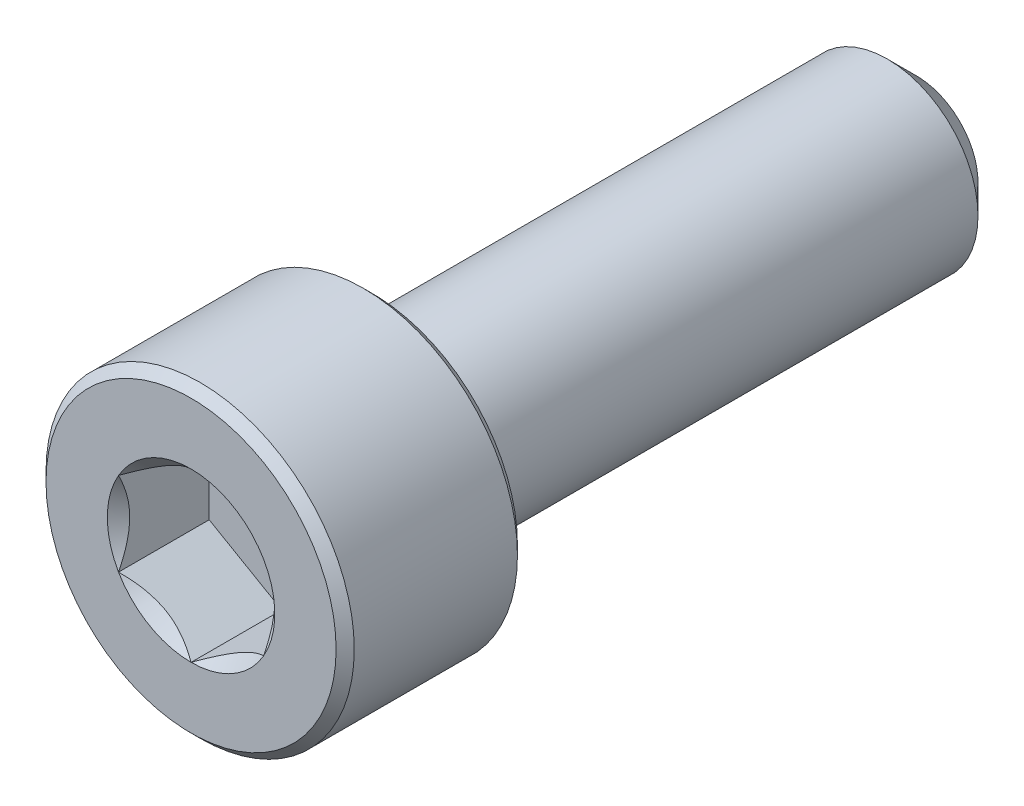
ISO-10303-21;
HEADER;
FILE_DESCRIPTION(('STEP AP214'),'2;1');
FILE_NAME('part.step','',(''),(''),'','','');
FILE_SCHEMA(('AUTOMOTIVE_DESIGN { 1 0 10303 214 1 1 1 1 }'));
ENDSEC;
DATA;
#1=APPLICATION_CONTEXT('core data for automotive mechanical design processes');
#2=APPLICATION_PROTOCOL_DEFINITION('international standard','automotive_design',2000,#1);
#3=PRODUCT_CONTEXT('',#1,'mechanical');
#4=PRODUCT('Part','Part','',(#3));
#5=PRODUCT_RELATED_PRODUCT_CATEGORY('part','',(#4));
#6=PRODUCT_DEFINITION_FORMATION('','',#4);
#7=PRODUCT_DEFINITION_CONTEXT('part definition',#1,'design');
#8=PRODUCT_DEFINITION('design','',#6,#7);
#9=PRODUCT_DEFINITION_SHAPE('','',#8);
#10=(LENGTH_UNIT() NAMED_UNIT(*) SI_UNIT(.MILLI.,.METRE.));
#11=(NAMED_UNIT(*) PLANE_ANGLE_UNIT() SI_UNIT($,.RADIAN.));
#12=(NAMED_UNIT(*) SI_UNIT($,.STERADIAN.) SOLID_ANGLE_UNIT());
#13=UNCERTAINTY_MEASURE_WITH_UNIT(LENGTH_MEASURE(1.E-05),#10,'distance_accuracy_value','');
#14=(GEOMETRIC_REPRESENTATION_CONTEXT(3) GLOBAL_UNCERTAINTY_ASSIGNED_CONTEXT((#13)) GLOBAL_UNIT_ASSIGNED_CONTEXT((#10,
#11,#12)) REPRESENTATION_CONTEXT('',''));
#15=CARTESIAN_POINT('',(0.,0.,0.));
#16=DIRECTION('',(0.,0.,1.));
#17=DIRECTION('',(1.,0.,0.));
#18=AXIS2_PLACEMENT_3D('',#15,#16,#17);
#19=CARTESIAN_POINT('',(0.,4.,10.));
#20=DIRECTION('',(0.,0.,1.));
#21=DIRECTION('',(1.,0.,0.));
#22=AXIS2_PLACEMENT_3D('',#19,#20,#21);
#23=PLANE('',#22);
#24=CARTESIAN_POINT('',(0.,0.,10.));
#25=DIRECTION('',(0.,0.,1.));
#26=DIRECTION('',(1.,0.,0.));
#27=AXIS2_PLACEMENT_3D('',#24,#25,#26);
#28=CIRCLE('',#27,2.3094010767585);
#29=CARTESIAN_POINT('',(2.,1.15470053837925,10.));
#30=VERTEX_POINT('',#29);
#31=CARTESIAN_POINT('',(0.,2.3094010767585,10.));
#32=VERTEX_POINT('',#31);
#33=EDGE_CURVE('E92',#30,#32,#28,.T.);
#34=ORIENTED_EDGE('',*,*,#33,.F.);
#35=CARTESIAN_POINT('',(2.,-1.15470053837925,10.));
#36=VERTEX_POINT('',#35);
#37=EDGE_CURVE('E52',#36,#30,#28,.T.);
#38=ORIENTED_EDGE('',*,*,#37,.F.);
#39=CARTESIAN_POINT('',(0.,-2.3094010767585,10.));
#40=VERTEX_POINT('',#39);
#41=EDGE_CURVE('E278',#40,#36,#28,.T.);
#42=ORIENTED_EDGE('',*,*,#41,.F.);
#43=CARTESIAN_POINT('',(-2.,-1.15470053837925,10.));
#44=VERTEX_POINT('',#43);
#45=EDGE_CURVE('E59',#44,#40,#28,.T.);
#46=ORIENTED_EDGE('',*,*,#45,.F.);
#47=CARTESIAN_POINT('',(-2.,1.15470053837925,10.));
#48=VERTEX_POINT('',#47);
#49=EDGE_CURVE('E128',#48,#44,#28,.T.);
#50=ORIENTED_EDGE('',*,*,#49,.F.);
#51=EDGE_CURVE('E101',#32,#48,#28,.T.);
#52=ORIENTED_EDGE('',*,*,#51,.F.);
#53=EDGE_LOOP('',(#34,#38,#42,#46,#50,#52));
#54=FACE_BOUND('',#53,.T.);
#55=CARTESIAN_POINT('',(0.,0.,10.));
#56=DIRECTION('',(0.,0.,-1.));
#57=DIRECTION('',(-1.,0.,0.));
#58=AXIS2_PLACEMENT_3D('',#55,#56,#57);
#59=CIRCLE('',#58,4.);
#60=CARTESIAN_POINT('',(-4.,0.,10.));
#61=VERTEX_POINT('',#60);
#62=EDGE_CURVE('E46',#61,#61,#59,.T.);
#63=ORIENTED_EDGE('',*,*,#62,.F.);
#64=EDGE_LOOP('',(#63));
#65=FACE_BOUND('',#64,.T.);
#66=ADVANCED_FACE('F33',(#54,#65),#23,.T.);
#67=CARTESIAN_POINT('',(0.,0.,9.75));
#68=DIRECTION('',(0.,0.,-1.));
#69=DIRECTION('',(-1.,0.,0.));
#70=AXIS2_PLACEMENT_3D('',#67,#68,#69);
#71=CONICAL_SURFACE('',#70,4.25,0.78539816339745);
#72=ORIENTED_EDGE('',*,*,#62,.T.);
#73=EDGE_LOOP('',(#72));
#74=FACE_BOUND('',#73,.T.);
#75=CARTESIAN_POINT('',(0.,0.,9.75));
#76=DIRECTION('',(0.,0.,-1.));
#77=DIRECTION('',(-1.,0.,0.));
#78=AXIS2_PLACEMENT_3D('',#75,#76,#77);
#79=CIRCLE('',#78,4.25);
#80=CARTESIAN_POINT('',(-4.25,0.,9.75));
#81=VERTEX_POINT('',#80);
#82=EDGE_CURVE('E212',#81,#81,#79,.T.);
#83=ORIENTED_EDGE('',*,*,#82,.F.);
#84=EDGE_LOOP('',(#83));
#85=FACE_BOUND('',#84,.T.);
#86=ADVANCED_FACE('F217',(#74,#85),#71,.T.);
#87=CARTESIAN_POINT('',(0.,0.,-10.));
#88=DIRECTION('',(0.,0.,-1.));
#89=DIRECTION('',(-1.,0.,0.));
#90=AXIS2_PLACEMENT_3D('',#87,#88,#89);
#91=CYLINDRICAL_SURFACE('',#90,4.25);
#92=ORIENTED_EDGE('',*,*,#82,.T.);
#93=EDGE_LOOP('',(#92));
#94=FACE_BOUND('',#93,.T.);
#95=CARTESIAN_POINT('',(0.,0.,5.25));
#96=DIRECTION('',(0.,0.,-1.));
#97=DIRECTION('',(-1.,0.,0.));
#98=AXIS2_PLACEMENT_3D('',#95,#96,#97);
#99=CIRCLE('',#98,4.25);
#100=CARTESIAN_POINT('',(-4.25,0.,5.25));
#101=VERTEX_POINT('',#100);
#102=EDGE_CURVE('E209',#101,#101,#99,.T.);
#103=ORIENTED_EDGE('',*,*,#102,.F.);
#104=EDGE_LOOP('',(#103));
#105=FACE_BOUND('',#104,.T.);
#106=ADVANCED_FACE('F223',(#94,#105),#91,.T.);
#107=CARTESIAN_POINT('',(0.,0.,5.));
#108=DIRECTION('',(0.,0.,1.));
#109=DIRECTION('',(1.,0.,0.));
#110=AXIS2_PLACEMENT_3D('',#107,#108,#109);
#111=CONICAL_SURFACE('',#110,4.,0.785398163397452);
#112=ORIENTED_EDGE('',*,*,#102,.T.);
#113=EDGE_LOOP('',(#112));
#114=FACE_BOUND('',#113,.T.);
#115=CARTESIAN_POINT('',(0.,0.,5.));
#116=DIRECTION('',(0.,0.,-1.));
#117=DIRECTION('',(-1.,0.,0.));
#118=AXIS2_PLACEMENT_3D('',#115,#116,#117);
#119=CIRCLE('',#118,4.);
#120=CARTESIAN_POINT('',(-4.,0.,5.));
#121=VERTEX_POINT('',#120);
#122=EDGE_CURVE('E206',#121,#121,#119,.T.);
#123=ORIENTED_EDGE('',*,*,#122,.F.);
#124=EDGE_LOOP('',(#123));
#125=FACE_BOUND('',#124,.T.);
#126=ADVANCED_FACE('F227',(#114,#125),#111,.T.);
#127=CARTESIAN_POINT('',(0.,4.,5.));
#128=DIRECTION('',(0.,0.,-1.));
#129=DIRECTION('',(-1.,0.,0.));
#130=AXIS2_PLACEMENT_3D('',#127,#128,#129);
#131=PLANE('',#130);
#132=ORIENTED_EDGE('',*,*,#122,.T.);
#133=EDGE_LOOP('',(#132));
#134=FACE_BOUND('',#133,.T.);
#135=CARTESIAN_POINT('',(0.,0.,5.));
#136=DIRECTION('',(0.,0.,-1.));
#137=DIRECTION('',(-1.,0.,0.));
#138=AXIS2_PLACEMENT_3D('',#135,#136,#137);
#139=CIRCLE('',#138,2.5);
#140=CARTESIAN_POINT('',(-2.5,0.,5.));
#141=VERTEX_POINT('',#140);
#142=EDGE_CURVE('E203',#141,#141,#139,.T.);
#143=ORIENTED_EDGE('',*,*,#142,.F.);
#144=EDGE_LOOP('',(#143));
#145=FACE_BOUND('',#144,.T.);
#146=ADVANCED_FACE('F233',(#134,#145),#131,.T.);
#147=CARTESIAN_POINT('',(0.,0.,-10.));
#148=DIRECTION('',(0.,0.,-1.));
#149=DIRECTION('',(-1.,0.,0.));
#150=AXIS2_PLACEMENT_3D('',#147,#148,#149);
#151=CYLINDRICAL_SURFACE('',#150,2.5);
#152=ORIENTED_EDGE('',*,*,#142,.T.);
#153=EDGE_LOOP('',(#152));
#154=FACE_BOUND('',#153,.T.);
#155=CARTESIAN_POINT('',(0.,0.,-9.19999999999999));
#156=DIRECTION('',(0.,0.,-1.));
#157=DIRECTION('',(-1.,0.,0.));
#158=AXIS2_PLACEMENT_3D('',#155,#156,#157);
#159=CIRCLE('',#158,2.5);
#160=CARTESIAN_POINT('',(-2.5,0.,-9.19999999999999));
#161=VERTEX_POINT('',#160);
#162=EDGE_CURVE('E200',#161,#161,#159,.T.);
#163=ORIENTED_EDGE('',*,*,#162,.F.);
#164=EDGE_LOOP('',(#163));
#165=FACE_BOUND('',#164,.T.);
#166=ADVANCED_FACE('F237',(#154,#165),#151,.T.);
#167=CARTESIAN_POINT('',(0.,0.,-10.));
#168=DIRECTION('',(0.,0.,1.));
#169=DIRECTION('',(1.,0.,0.));
#170=AXIS2_PLACEMENT_3D('',#167,#168,#169);
#171=CONICAL_SURFACE('',#170,1.7,0.785398163397443);
#172=ORIENTED_EDGE('',*,*,#162,.T.);
#173=EDGE_LOOP('',(#172));
#174=FACE_BOUND('',#173,.T.);
#175=CARTESIAN_POINT('',(0.,0.,-10.));
#176=DIRECTION('',(0.,0.,-1.));
#177=DIRECTION('',(-1.,0.,0.));
#178=AXIS2_PLACEMENT_3D('',#175,#176,#177);
#179=CIRCLE('',#178,1.7);
#180=CARTESIAN_POINT('',(-1.7,0.,-10.));
#181=VERTEX_POINT('',#180);
#182=EDGE_CURVE('E188',#181,#181,#179,.T.);
#183=ORIENTED_EDGE('',*,*,#182,.F.);
#184=EDGE_LOOP('',(#183));
#185=FACE_BOUND('',#184,.T.);
#186=ADVANCED_FACE('F240',(#174,#185),#171,.T.);
#187=CARTESIAN_POINT('',(0.,1.7,-10.));
#188=DIRECTION('',(0.,0.,-1.));
#189=DIRECTION('',(-1.,0.,0.));
#190=AXIS2_PLACEMENT_3D('',#187,#188,#189);
#191=PLANE('',#190);
#192=ORIENTED_EDGE('',*,*,#182,.T.);
#193=EDGE_LOOP('',(#192));
#194=FACE_BOUND('',#193,.T.);
#195=ADVANCED_FACE('F161',(#194),#191,.T.);
#196=CARTESIAN_POINT('',(0.,0.,10.));
#197=DIRECTION('',(0.,0.,1.));
#198=DIRECTION('',(1.,0.,0.));
#199=AXIS2_PLACEMENT_3D('',#196,#197,#198);
#200=CONICAL_SURFACE('',#199,2.3094010767585,0.78539816339745);
#201=ORIENTED_EDGE('',*,*,#51,.T.);
#202=CARTESIAN_POINT('',(0.000200000000000219,2.30951654681234,10.0001154787137));
#203=CARTESIAN_POINT('',(-0.068553034030705,2.26982196410711,9.96045309022559));
#204=CARTESIAN_POINT('',(-0.138455742135511,2.22946361676572,9.92311998228416));
#205=CARTESIAN_POINT('',(-0.280995244550436,2.14716839667631,9.85476368513615));
#206=CARTESIAN_POINT('',(-0.353645597565358,2.10522369580642,9.82377853373722));
#207=CARTESIAN_POINT('',(-0.500141601053971,2.02064418875706,9.77070021654414));
#208=CARTESIAN_POINT('',(-0.573949935246294,1.97803092714269,9.74847362717661));
#209=CARTESIAN_POINT('',(-0.723191631835264,1.89186619344273,9.71422881667508));
#210=CARTESIAN_POINT('',(-0.798620433918152,1.84831735425552,9.70218502914414));
#211=CARTESIAN_POINT('',(-0.928615500671079,1.7732646674724,9.69131851190557));
#212=CARTESIAN_POINT('',(-0.983013783970109,1.74185780396625,9.68970975360997));
#213=CARTESIAN_POINT('',(-1.09172145551969,1.67909540053412,9.69241887759871));
#214=CARTESIAN_POINT('',(-1.14603080592134,1.64773988246022,9.69673883775797));
#215=CARTESIAN_POINT('',(-1.25413672758934,1.5853248994842,9.71105956740991));
#216=CARTESIAN_POINT('',(-1.30793265655479,1.55426580541469,9.72106669276201));
#217=CARTESIAN_POINT('',(-1.41459426230557,1.49268469862228,9.74621243024966));
#218=CARTESIAN_POINT('',(-1.46746001007071,1.46216264491917,9.76135064904224));
#219=CARTESIAN_POINT('',(-1.60287973308984,1.38397803138049,9.80629450342919));
#220=CARTESIAN_POINT('',(-1.68459383484948,1.33680037273297,9.83948883942582));
#221=CARTESIAN_POINT('',(-1.8047470372578,1.26742988897853,9.89552582317137));
#222=CARTESIAN_POINT('',(-1.84434285210918,1.24456923461531,9.91521470294694));
#223=CARTESIAN_POINT('',(-1.92280095888787,1.19927142554652,9.95638731836487));
#224=CARTESIAN_POINT('',(-1.96166368359374,1.17683402097614,9.97786995165125));
#225=CARTESIAN_POINT('',(-2.0002,1.15458506832541,10.0001154787137));
#226=B_SPLINE_CURVE_WITH_KNOTS('',3,(#202,#203,#204,#205,#206,#207,#208,#209,#210,#211,#212,
#213,#214,#215,#216,#217,#218,#219,#220,#221,#222,#223,#224,#225),.UNSPECIFIED.,.F.,.F.,(4,2,2,
2,2,2,2,2,2,2,2,4),(0.,0.266420613771063,0.534393751523388,0.798110374376914,1.06116288956936,
1.24939906803722,1.43770123566247,1.62621426093932,1.81471283831913,2.11415604834145,
2.26347170717791,2.41269626969771),.UNSPECIFIED.);
#227=EDGE_CURVE('E11',#32,#48,#226,.T.);
#228=ORIENTED_EDGE('',*,*,#227,.F.);
#229=EDGE_LOOP('',(#201,#228));
#230=FACE_BOUND('',#229,.T.);
#231=ADVANCED_FACE('F105',(#230),#200,.F.);
#232=ORIENTED_EDGE('',*,*,#49,.T.);
#233=CARTESIAN_POINT('',(-2.,-2.33350792809314,10.7639129733303));
#234=CARTESIAN_POINT('',(-2.,-2.27682524005105,10.7208846581945));
#235=CARTESIAN_POINT('',(-2.,-2.21982863127677,10.6782632196867));
#236=CARTESIAN_POINT('',(-2.,-2.10508243227164,10.5940173538232));
#237=CARTESIAN_POINT('',(-2.,-2.04733265969732,10.5523931750969));
#238=CARTESIAN_POINT('',(-2.,-1.9305325076875,10.4700289390981));
#239=CARTESIAN_POINT('',(-2.,-1.87147552066419,10.429298220564));
#240=CARTESIAN_POINT('',(-2.,-1.75236453496771,10.3493264895712));
#241=CARTESIAN_POINT('',(-2.,-1.69231060660119,10.3100853726983));
#242=CARTESIAN_POINT('',(-2.,-1.567471533448,10.231167878885));
#243=CARTESIAN_POINT('',(-2.,-1.50261611656329,10.1916021023748));
#244=CARTESIAN_POINT('',(-2.,-1.37138716901082,10.1150292158728));
#245=CARTESIAN_POINT('',(-2.,-1.30501336962871,10.078022563515));
#246=CARTESIAN_POINT('',(-2.,-1.17075263037878,10.0073667392341));
#247=CARTESIAN_POINT('',(-2.,-1.10287104348427,9.97370747514608));
#248=CARTESIAN_POINT('',(-2.,-0.96522809254686,9.91049315112672));
#249=CARTESIAN_POINT('',(-2.,-0.895467367515904,9.88093671652697));
#250=CARTESIAN_POINT('',(-2.,-0.760038155655725,9.82931025785436));
#251=CARTESIAN_POINT('',(-2.,-0.694533426178474,9.80681508107925));
#252=CARTESIAN_POINT('',(-2.,-0.561920164972267,9.76707588844303));
#253=CARTESIAN_POINT('',(-2.,-0.494811525645963,9.74983222594905));
#254=CARTESIAN_POINT('',(-2.,-0.360522211095495,9.72179275650282));
#255=CARTESIAN_POINT('',(-2.,-0.293365389163158,9.71088458822734));
#256=CARTESIAN_POINT('',(-2.,-0.158300090029279,9.69573270261191));
#257=CARTESIAN_POINT('',(-2.,-0.0903917516002773,9.69148777487641));
#258=CARTESIAN_POINT('',(-2.,0.0429020652606309,9.68999114215311));
#259=CARTESIAN_POINT('',(-2.,0.108284684169078,9.6924781450741));
#260=CARTESIAN_POINT('',(-2.,0.23850440969295,9.70372439320255));
#261=CARTESIAN_POINT('',(-2.,0.303341463641695,9.71248423709365));
#262=CARTESIAN_POINT('',(-2.,0.433098840648744,9.73594152298035));
#263=CARTESIAN_POINT('',(-2.,0.498000415627631,9.75074108464347));
#264=CARTESIAN_POINT('',(-2.,0.626381661351717,9.7854820388306));
#265=CARTESIAN_POINT('',(-2.,0.689861439952175,9.8054230398874));
#266=CARTESIAN_POINT('',(-2.,0.888345745687483,9.87531214536041));
#267=CARTESIAN_POINT('',(-2.,1.02055912670982,9.9331624710628));
#268=CARTESIAN_POINT('',(-2.,1.27879697777602,10.0618231959499));
#269=CARTESIAN_POINT('',(-2.,1.40479723810913,10.1326798810734));
#270=CARTESIAN_POINT('',(-2.,1.58692013279987,10.2432796363255));
#271=CARTESIAN_POINT('',(-2.,1.64501521895223,10.2798382435255));
#272=CARTESIAN_POINT('',(-2.,1.76020814703229,10.3545059144978));
#273=CARTESIAN_POINT('',(-2.,1.81730591318335,10.3926150953569));
#274=CARTESIAN_POINT('',(-2.,1.93017247334117,10.4697864647308));
#275=CARTESIAN_POINT('',(-2.,1.98594828328331,10.5088384434598));
#276=CARTESIAN_POINT('',(-2.,2.09673667795809,10.5879797964898));
#277=CARTESIAN_POINT('',(-2.,2.15174946854703,10.6280688822828));
#278=CARTESIAN_POINT('',(-2.,2.20644261038877,10.6685829717111));
#279=B_SPLINE_CURVE_WITH_KNOTS('',3,(#233,#234,#235,#236,#237,#238,#239,#240,#241,#242,#243,
#244,#245,#246,#247,#248,#249,#250,#251,#252,#253,#254,#255,#256,#257,#258,#259,#260,#261,#262,
#263,#264,#265,#266,#267,#268,#269,#270,#271,#272,#273,#274,#275,#276,#277,#278),.UNSPECIFIED.,
.F.,.F.,(4,2,2,2,2,2,2,2,2,2,2,2,2,2,2,2,2,2,2,2,2,2,4),(0.,0.213497148294753,0.427046981593394,
0.642249974749849,0.857437855216921,1.08530552050929,1.31321382930987,1.54041273599371,
1.76753533413947,1.97513287362836,2.18274437898411,2.38655158594355,2.59032176649044,
2.78629737352115,2.98229168707252,3.18174703964799,3.38118721025193,3.81287365989454,
4.24612724012855,4.45203046308782,4.65794926316182,4.86220142187746,5.06639735899165),.UNSPECIFIED.);
#280=EDGE_CURVE('E100',#48,#44,#279,.F.);
#281=ORIENTED_EDGE('',*,*,#280,.F.);
#282=EDGE_LOOP('',(#232,#281));
#283=FACE_BOUND('',#282,.T.);
#284=ADVANCED_FACE('F255',(#283),#200,.F.);
#285=ORIENTED_EDGE('',*,*,#45,.T.);
#286=CARTESIAN_POINT('',(-2.0002,-1.15458506832541,10.0001154787137));
#287=CARTESIAN_POINT('',(-1.93144696596929,-1.19427965103065,9.96045309022559));
#288=CARTESIAN_POINT('',(-1.86154425786449,-1.23463799837204,9.92311998228416));
#289=CARTESIAN_POINT('',(-1.71900475544956,-1.31693321846145,9.85476368513614));
#290=CARTESIAN_POINT('',(-1.64635440243464,-1.35887791933134,9.82377853373722));
#291=CARTESIAN_POINT('',(-1.49985839894603,-1.44345742638069,9.77070021654414));
#292=CARTESIAN_POINT('',(-1.42605006475371,-1.48607068799507,9.74847362717661));
#293=CARTESIAN_POINT('',(-1.27680836816474,-1.57223542169503,9.71422881667508));
#294=CARTESIAN_POINT('',(-1.20137956608185,-1.61578426088223,9.70218502914413));
#295=CARTESIAN_POINT('',(-1.07138449932892,-1.69083694766536,9.69131851190557));
#296=CARTESIAN_POINT('',(-1.01698621602989,-1.72224381117151,9.68970975360997));
#297=CARTESIAN_POINT('',(-0.908278544480307,-1.78500621460364,9.69241887759871));
#298=CARTESIAN_POINT('',(-0.853969194078662,-1.81636173267754,9.69673883775797));
#299=CARTESIAN_POINT('',(-0.745863272410663,-1.87877671565355,9.7110595674099));
#300=CARTESIAN_POINT('',(-0.692067343445209,-1.90983580972306,9.72106669276201));
#301=CARTESIAN_POINT('',(-0.585405737694427,-1.97141691651547,9.74621243024966));
#302=CARTESIAN_POINT('',(-0.532539989929288,-2.00193897021859,9.76135064904224));
#303=CARTESIAN_POINT('',(-0.397120266910157,-2.08012358375727,9.80629450342919));
#304=CARTESIAN_POINT('',(-0.315406165150523,-2.12730124240478,9.83948883942582));
#305=CARTESIAN_POINT('',(-0.195252962742199,-2.19667172615922,9.89552582317137));
#306=CARTESIAN_POINT('',(-0.155657147890825,-2.21953238052245,9.91521470294694));
#307=CARTESIAN_POINT('',(-0.0771990411121298,-2.26483018959124,9.95638731836487));
#308=CARTESIAN_POINT('',(-0.0383363164062618,-2.28726759416161,9.97786995165125));
#309=CARTESIAN_POINT('',(0.000199999999997879,-2.30951654681234,10.0001154787137));
#310=B_SPLINE_CURVE_WITH_KNOTS('',3,(#286,#287,#288,#289,#290,#291,#292,#293,#294,#295,#296,
#297,#298,#299,#300,#301,#302,#303,#304,#305,#306,#307,#308,#309),.UNSPECIFIED.,.F.,.F.,(4,2,2,
2,2,2,2,2,2,2,2,4),(0.,0.266420613771064,0.534393751523388,0.798110374376913,1.06116288956936,
1.24939906803722,1.43770123566247,1.62621426093931,1.81471283831913,2.11415604834144,
2.2634717071779,2.4126962696977),.UNSPECIFIED.);
#311=EDGE_CURVE('E137',#44,#40,#310,.T.);
#312=ORIENTED_EDGE('',*,*,#311,.F.);
#313=EDGE_LOOP('',(#285,#312));
#314=FACE_BOUND('',#313,.T.);
#315=ADVANCED_FACE('F259',(#314),#200,.F.);
#316=ORIENTED_EDGE('',*,*,#41,.T.);
#317=CARTESIAN_POINT('',(-0.000200000000001455,-2.30951654681234,10.0001154787137));
#318=CARTESIAN_POINT('',(0.0685530340307037,-2.26982196410711,9.96045309022559));
#319=CARTESIAN_POINT('',(0.13845574213551,-2.22946361676572,9.92311998228416));
#320=CARTESIAN_POINT('',(0.280995244550434,-2.1471683966763,9.85476368513614));
#321=CARTESIAN_POINT('',(0.353645597565357,-2.10522369580642,9.82377853373722));
#322=CARTESIAN_POINT('',(0.50014160105397,-2.02064418875706,9.77070021654414));
#323=CARTESIAN_POINT('',(0.573949935246293,-1.97803092714269,9.74847362717661));
#324=CARTESIAN_POINT('',(0.723191631835263,-1.89186619344273,9.71422881667508));
#325=CARTESIAN_POINT('',(0.798620433918151,-1.84831735425552,9.70218502914414));
#326=CARTESIAN_POINT('',(0.928615500671078,-1.7732646674724,9.69131851190557));
#327=CARTESIAN_POINT('',(0.983013783970108,-1.74185780396625,9.68970975360997));
#328=CARTESIAN_POINT('',(1.09172145551969,-1.67909540053412,9.69241887759871));
#329=CARTESIAN_POINT('',(1.14603080592134,-1.64773988246021,9.69673883775797));
#330=CARTESIAN_POINT('',(1.25413672758934,-1.5853248994842,9.71105956740991));
#331=CARTESIAN_POINT('',(1.30793265655479,-1.55426580541469,9.72106669276201));
#332=CARTESIAN_POINT('',(1.41459426230557,-1.49268469862228,9.74621243024966));
#333=CARTESIAN_POINT('',(1.46746001007071,-1.46216264491917,9.76135064904224));
#334=CARTESIAN_POINT('',(1.60287973308984,-1.38397803138049,9.80629450342919));
#335=CARTESIAN_POINT('',(1.68459383484948,-1.33680037273297,9.83948883942582));
#336=CARTESIAN_POINT('',(1.8047470372578,-1.26742988897853,9.89552582317137));
#337=CARTESIAN_POINT('',(1.84434285210918,-1.24456923461531,9.91521470294694));
#338=CARTESIAN_POINT('',(1.92280095888787,-1.19927142554652,9.95638731836487));
#339=CARTESIAN_POINT('',(1.96166368359374,-1.17683402097614,9.97786995165125));
#340=CARTESIAN_POINT('',(2.0002,-1.15458506832541,10.0001154787137));
#341=B_SPLINE_CURVE_WITH_KNOTS('',3,(#317,#318,#319,#320,#321,#322,#323,#324,#325,#326,#327,
#328,#329,#330,#331,#332,#333,#334,#335,#336,#337,#338,#339,#340),.UNSPECIFIED.,.F.,.F.,(4,2,2,
2,2,2,2,2,2,2,2,4),(0.,0.266420613771063,0.534393751523388,0.798110374376914,1.06116288956936,
1.24939906803722,1.43770123566247,1.62621426093932,1.81471283831913,2.11415604834145,
2.2634717071779,2.41269626969771),.UNSPECIFIED.);
#342=EDGE_CURVE('E280',#40,#36,#341,.T.);
#343=ORIENTED_EDGE('',*,*,#342,.F.);
#344=EDGE_LOOP('',(#316,#343));
#345=FACE_BOUND('',#344,.T.);
#346=ADVANCED_FACE('F268',(#345),#200,.F.);
#347=ORIENTED_EDGE('',*,*,#37,.T.);
#348=CARTESIAN_POINT('',(2.,-2.3335079282084,10.7639129734179));
#349=CARTESIAN_POINT('',(2.,-2.27682524016305,10.7208846582787));
#350=CARTESIAN_POINT('',(2.,-2.21982863138551,10.6782632197674));
#351=CARTESIAN_POINT('',(2.,-2.1050824323738,10.5940173538972));
#352=CARTESIAN_POINT('',(2.,-2.04733265979617,10.5523931751676));
#353=CARTESIAN_POINT('',(2.,-1.93053250777963,10.4700289391621));
#354=CARTESIAN_POINT('',(2.,-1.8714755207529,10.4292982206246));
#355=CARTESIAN_POINT('',(2.,-1.75236453504953,10.3493264896251));
#356=CARTESIAN_POINT('',(2.,-1.69231060667954,10.3100853727489));
#357=CARTESIAN_POINT('',(2.,-1.56747153351884,10.2311678789286));
#358=CARTESIAN_POINT('',(2.,-1.5026161166301,10.1916021024149));
#359=CARTESIAN_POINT('',(2.,-1.37138716906941,10.1150292159059));
#360=CARTESIAN_POINT('',(2.,-1.30501336968313,10.0780225635447));
#361=CARTESIAN_POINT('',(2.,-1.17075263042469,10.0073667392572));
#362=CARTESIAN_POINT('',(2.,-1.10287104352586,9.97370747516608));
#363=CARTESIAN_POINT('',(2.,-0.965228092579558,9.91049315114084));
#364=CARTESIAN_POINT('',(2.,-0.895467367544042,9.88093671653835));
#365=CARTESIAN_POINT('',(2.,-0.760038155681911,9.82931025786375));
#366=CARTESIAN_POINT('',(2.,-0.694533426207471,9.80681508108886));
#367=CARTESIAN_POINT('',(2.,-0.561920165006982,9.76707588845251));
#368=CARTESIAN_POINT('',(2.,-0.494811525683585,9.74983222595819));
#369=CARTESIAN_POINT('',(2.,-0.360522211138837,9.72179275651061));
#370=CARTESIAN_POINT('',(2.,-0.293365389209313,9.71088458823414));
#371=CARTESIAN_POINT('',(2.,-0.15830009008097,9.69573270261609));
#372=CARTESIAN_POINT('',(2.,-0.0903917516546917,9.69148777487896));
#373=CARTESIAN_POINT('',(2.,0.0429020652013076,9.68999114215191));
#374=CARTESIAN_POINT('',(2.,0.108284684107563,9.69247814507083));
#375=CARTESIAN_POINT('',(2.,0.238504409627276,9.70372439319483));
#376=CARTESIAN_POINT('',(2.,0.303341463574056,9.71248423708354));
#377=CARTESIAN_POINT('',(2.,0.433098840577223,9.73594152296526));
#378=CARTESIAN_POINT('',(2.,0.498000415554201,9.75074108462575));
#379=CARTESIAN_POINT('',(2.,0.626381661274659,9.7854820388076));
#380=CARTESIAN_POINT('',(2.,0.689861439873398,9.80542303986172));
#381=CARTESIAN_POINT('',(2.,0.888345745591677,9.8753121453222));
#382=CARTESIAN_POINT('',(2.,1.02055912659956,9.93316247101307));
#383=CARTESIAN_POINT('',(2.,1.27879697763796,10.0618231958759));
#384=CARTESIAN_POINT('',(2.,1.40479723795773,10.1326798809865));
#385=CARTESIAN_POINT('',(2.,1.58692013262996,10.2432796362199));
#386=CARTESIAN_POINT('',(2.,1.64501521877692,10.2798382434142));
#387=CARTESIAN_POINT('',(2.,1.76020814684622,10.3545059143749));
#388=CARTESIAN_POINT('',(2.,1.81730591299196,10.3926150952282));
#389=CARTESIAN_POINT('',(2.,1.93017247313923,10.4697864645906));
#390=CARTESIAN_POINT('',(2.,1.98594828307617,10.5088384433139));
#391=CARTESIAN_POINT('',(2.,2.09673667774057,10.5879797963324));
#392=CARTESIAN_POINT('',(2.,2.15174946832434,10.6280688821197));
#393=CARTESIAN_POINT('',(2.,2.20644261016092,10.6685829715422));
#394=B_SPLINE_CURVE_WITH_KNOTS('',3,(#348,#349,#350,#351,#352,#353,#354,#355,#356,#357,#358,
#359,#360,#361,#362,#363,#364,#365,#366,#367,#368,#369,#370,#371,#372,#373,#374,#375,#376,#377,
#378,#379,#380,#381,#382,#383,#384,#385,#386,#387,#388,#389,#390,#391,#392,#393),.UNSPECIFIED.,
.F.,.F.,(4,2,2,2,2,2,2,2,2,2,2,2,2,2,2,2,2,2,2,2,2,2,4),(0.,0.213497148308672,0.427046981621236,
0.642249974791875,0.85743785527313,1.08530552058142,1.31321382939793,1.54041273609756,
1.76753533425909,1.97513287373982,2.18274437908743,2.38655158603907,2.59032176657815,
2.78629737360208,2.98229168714667,3.18174703971481,3.38118721031143,3.81287365990069,
4.24612724008101,4.45203046301732,4.65794926306836,4.86220142176135,5.06639735885289),.UNSPECIFIED.);
#395=EDGE_CURVE('E117',#36,#30,#394,.T.);
#396=ORIENTED_EDGE('',*,*,#395,.F.);
#397=EDGE_LOOP('',(#347,#396));
#398=FACE_BOUND('',#397,.T.);
#399=ADVANCED_FACE('F262',(#398),#200,.F.);
#400=ORIENTED_EDGE('',*,*,#33,.T.);
#401=CARTESIAN_POINT('',(2.0002,1.15458506832542,10.0001154787137));
#402=CARTESIAN_POINT('',(1.93144696596929,1.19427965103065,9.96045309022559));
#403=CARTESIAN_POINT('',(1.86154425786449,1.23463799837204,9.92311998228416));
#404=CARTESIAN_POINT('',(1.71900475544956,1.31693321846145,9.85476368513614));
#405=CARTESIAN_POINT('',(1.64635440243464,1.35887791933134,9.82377853373722));
#406=CARTESIAN_POINT('',(1.49985839894603,1.44345742638069,9.77070021654414));
#407=CARTESIAN_POINT('',(1.42605006475371,1.48607068799507,9.74847362717661));
#408=CARTESIAN_POINT('',(1.27680836816474,1.57223542169503,9.71422881667508));
#409=CARTESIAN_POINT('',(1.20137956608185,1.61578426088223,9.70218502914414));
#410=CARTESIAN_POINT('',(1.07138449932892,1.69083694766536,9.69131851190557));
#411=CARTESIAN_POINT('',(1.01698621602989,1.72224381117151,9.68970975360997));
#412=CARTESIAN_POINT('',(0.908278544480307,1.78500621460364,9.69241887759871));
#413=CARTESIAN_POINT('',(0.853969194078662,1.81636173267754,9.69673883775797));
#414=CARTESIAN_POINT('',(0.745863272410663,1.87877671565355,9.7110595674099));
#415=CARTESIAN_POINT('',(0.692067343445209,1.90983580972306,9.72106669276201));
#416=CARTESIAN_POINT('',(0.585405737694427,1.97141691651547,9.74621243024966));
#417=CARTESIAN_POINT('',(0.532539989929288,2.00193897021859,9.76135064904224));
#418=CARTESIAN_POINT('',(0.397120266910156,2.08012358375727,9.80629450342919));
#419=CARTESIAN_POINT('',(0.315406165150522,2.12730124240478,9.83948883942582));
#420=CARTESIAN_POINT('',(0.195252962742198,2.19667172615922,9.89552582317137));
#421=CARTESIAN_POINT('',(0.155657147890823,2.21953238052245,9.91521470294694));
#422=CARTESIAN_POINT('',(0.0771990411121272,2.26483018959124,9.95638731836487));
#423=CARTESIAN_POINT('',(0.0383363164062592,2.28726759416161,9.97786995165125));
#424=CARTESIAN_POINT('',(-0.000200000000000176,2.30951654681234,10.0001154787137));
#425=B_SPLINE_CURVE_WITH_KNOTS('',3,(#401,#402,#403,#404,#405,#406,#407,#408,#409,#410,#411,
#412,#413,#414,#415,#416,#417,#418,#419,#420,#421,#422,#423,#424),.UNSPECIFIED.,.F.,.F.,(4,2,2,
2,2,2,2,2,2,2,2,4),(0.,0.266420613771063,0.534393751523387,0.798110374376912,1.06116288956936,
1.24939906803721,1.43770123566247,1.62621426093931,1.81471283831913,2.11415604834144,
2.2634717071779,2.41269626969771),.UNSPECIFIED.);
#426=EDGE_CURVE('E96',#30,#32,#425,.T.);
#427=ORIENTED_EDGE('',*,*,#426,.F.);
#428=EDGE_LOOP('',(#400,#427));
#429=FACE_BOUND('',#428,.T.);
#430=ADVANCED_FACE('F94',(#429),#200,.F.);
#431=CARTESIAN_POINT('',(0.,0.,7.5));
#432=DIRECTION('',(0.,0.,1.));
#433=DIRECTION('',(1.,0.,0.));
#434=AXIS2_PLACEMENT_3D('',#431,#432,#433);
#435=PLANE('',#434);
#436=DIRECTION('',(-0.866025403784439,0.5,0.));
#437=VECTOR('',#436,1.);
#438=CARTESIAN_POINT('',(2.,1.15470053837925,7.5));
#439=LINE('',#438,#437);
#440=CARTESIAN_POINT('',(2.,1.15470053837925,7.5));
#441=VERTEX_POINT('',#440);
#442=CARTESIAN_POINT('',(0.,2.3094010767585,7.5));
#443=VERTEX_POINT('',#442);
#444=EDGE_CURVE('E116',#441,#443,#439,.T.);
#445=ORIENTED_EDGE('',*,*,#444,.T.);
#446=DIRECTION('',(-0.866025403784439,-0.5,0.));
#447=VECTOR('',#446,1.);
#448=CARTESIAN_POINT('',(0.,2.3094010767585,7.5));
#449=LINE('',#448,#447);
#450=CARTESIAN_POINT('',(-2.,1.15470053837925,7.5));
#451=VERTEX_POINT('',#450);
#452=EDGE_CURVE('E121',#443,#451,#449,.T.);
#453=ORIENTED_EDGE('',*,*,#452,.T.);
#454=DIRECTION('',(0.,-1.,0.));
#455=VECTOR('',#454,1.);
#456=CARTESIAN_POINT('',(-2.,1.15470053837925,7.5));
#457=LINE('',#456,#455);
#458=CARTESIAN_POINT('',(-2.,-1.15470053837925,7.5));
#459=VERTEX_POINT('',#458);
#460=EDGE_CURVE('E176',#451,#459,#457,.T.);
#461=ORIENTED_EDGE('',*,*,#460,.T.);
#462=DIRECTION('',(0.866025403784439,-0.5,0.));
#463=VECTOR('',#462,1.);
#464=CARTESIAN_POINT('',(-2.,-1.15470053837925,7.5));
#465=LINE('',#464,#463);
#466=CARTESIAN_POINT('',(0.,-2.3094010767585,7.5));
#467=VERTEX_POINT('',#466);
#468=EDGE_CURVE('E179',#459,#467,#465,.T.);
#469=ORIENTED_EDGE('',*,*,#468,.T.);
#470=DIRECTION('',(0.866025403784439,0.5,0.));
#471=VECTOR('',#470,1.);
#472=CARTESIAN_POINT('',(0.,-2.3094010767585,7.5));
#473=LINE('',#472,#471);
#474=CARTESIAN_POINT('',(2.,-1.15470053837925,7.5));
#475=VERTEX_POINT('',#474);
#476=EDGE_CURVE('E182',#467,#475,#473,.T.);
#477=ORIENTED_EDGE('',*,*,#476,.T.);
#478=DIRECTION('',(0.,1.,0.));
#479=VECTOR('',#478,1.);
#480=CARTESIAN_POINT('',(2.,-1.15470053837925,7.5));
#481=LINE('',#480,#479);
#482=EDGE_CURVE('E124',#475,#441,#481,.T.);
#483=ORIENTED_EDGE('',*,*,#482,.T.);
#484=EDGE_LOOP('',(#445,#453,#461,#469,#477,#483));
#485=FACE_BOUND('',#484,.T.);
#486=ADVANCED_FACE('F156',(#485),#435,.T.);
#487=CARTESIAN_POINT('',(0.,2.3094010767585,7.5));
#488=DIRECTION('',(-0.5,0.866025403784439,0.));
#489=DIRECTION('',(-0.866025403784439,-0.5,0.));
#490=AXIS2_PLACEMENT_3D('',#487,#488,#489);
#491=PLANE('',#490);
#492=DIRECTION('',(0.,0.,1.));
#493=VECTOR('',#492,1.);
#494=CARTESIAN_POINT('',(0.,2.3094010767585,7.5));
#495=LINE('',#494,#493);
#496=EDGE_CURVE('E113',#443,#32,#495,.T.);
#497=ORIENTED_EDGE('',*,*,#496,.T.);
#498=ORIENTED_EDGE('',*,*,#227,.T.);
#499=DIRECTION('',(0.,0.,1.));
#500=VECTOR('',#499,1.);
#501=CARTESIAN_POINT('',(-2.,1.15470053837925,7.5));
#502=LINE('',#501,#500);
#503=EDGE_CURVE('E123',#451,#48,#502,.T.);
#504=ORIENTED_EDGE('',*,*,#503,.F.);
#505=ORIENTED_EDGE('',*,*,#452,.F.);
#506=EDGE_LOOP('',(#497,#498,#504,#505));
#507=FACE_BOUND('',#506,.T.);
#508=ADVANCED_FACE('F119',(#507),#491,.F.);
#509=CARTESIAN_POINT('',(-2.,1.15470053837925,7.5));
#510=DIRECTION('',(-1.,0.,0.));
#511=DIRECTION('',(0.,-1.,0.));
#512=AXIS2_PLACEMENT_3D('',#509,#510,#511);
#513=PLANE('',#512);
#514=ORIENTED_EDGE('',*,*,#503,.T.);
#515=ORIENTED_EDGE('',*,*,#280,.T.);
#516=DIRECTION('',(0.,0.,1.));
#517=VECTOR('',#516,1.);
#518=CARTESIAN_POINT('',(-2.,-1.15470053837925,7.5));
#519=LINE('',#518,#517);
#520=EDGE_CURVE('E194',#459,#44,#519,.T.);
#521=ORIENTED_EDGE('',*,*,#520,.F.);
#522=ORIENTED_EDGE('',*,*,#460,.F.);
#523=EDGE_LOOP('',(#514,#515,#521,#522));
#524=FACE_BOUND('',#523,.T.);
#525=ADVANCED_FACE('F146',(#524),#513,.F.);
#526=CARTESIAN_POINT('',(-2.,-1.15470053837925,7.5));
#527=DIRECTION('',(-0.5,-0.866025403784438,0.));
#528=DIRECTION('',(0.866025403784439,-0.5,0.));
#529=AXIS2_PLACEMENT_3D('',#526,#527,#528);
#530=PLANE('',#529);
#531=ORIENTED_EDGE('',*,*,#520,.T.);
#532=ORIENTED_EDGE('',*,*,#311,.T.);
#533=DIRECTION('',(0.,0.,1.));
#534=VECTOR('',#533,1.);
#535=CARTESIAN_POINT('',(0.,-2.3094010767585,7.5));
#536=LINE('',#535,#534);
#537=EDGE_CURVE('E191',#467,#40,#536,.T.);
#538=ORIENTED_EDGE('',*,*,#537,.F.);
#539=ORIENTED_EDGE('',*,*,#468,.F.);
#540=EDGE_LOOP('',(#531,#532,#538,#539));
#541=FACE_BOUND('',#540,.T.);
#542=ADVANCED_FACE('F149',(#541),#530,.F.);
#543=CARTESIAN_POINT('',(0.,-2.3094010767585,7.5));
#544=DIRECTION('',(0.5,-0.866025403784439,0.));
#545=DIRECTION('',(0.866025403784439,0.5,0.));
#546=AXIS2_PLACEMENT_3D('',#543,#544,#545);
#547=PLANE('',#546);
#548=ORIENTED_EDGE('',*,*,#537,.T.);
#549=ORIENTED_EDGE('',*,*,#342,.T.);
#550=DIRECTION('',(0.,0.,1.));
#551=VECTOR('',#550,1.);
#552=CARTESIAN_POINT('',(2.,-1.15470053837925,7.5));
#553=LINE('',#552,#551);
#554=EDGE_CURVE('E189',#475,#36,#553,.T.);
#555=ORIENTED_EDGE('',*,*,#554,.F.);
#556=ORIENTED_EDGE('',*,*,#476,.F.);
#557=EDGE_LOOP('',(#548,#549,#555,#556));
#558=FACE_BOUND('',#557,.T.);
#559=ADVANCED_FACE('F286',(#558),#547,.F.);
#560=CARTESIAN_POINT('',(2.,-1.15470053837925,7.5));
#561=DIRECTION('',(1.,0.,0.));
#562=DIRECTION('',(0.,1.,0.));
#563=AXIS2_PLACEMENT_3D('',#560,#561,#562);
#564=PLANE('',#563);
#565=ORIENTED_EDGE('',*,*,#554,.T.);
#566=ORIENTED_EDGE('',*,*,#395,.T.);
#567=DIRECTION('',(0.,0.,1.));
#568=VECTOR('',#567,1.);
#569=CARTESIAN_POINT('',(2.,1.15470053837925,7.5));
#570=LINE('',#569,#568);
#571=EDGE_CURVE('E115',#441,#30,#570,.T.);
#572=ORIENTED_EDGE('',*,*,#571,.F.);
#573=ORIENTED_EDGE('',*,*,#482,.F.);
#574=EDGE_LOOP('',(#565,#566,#572,#573));
#575=FACE_BOUND('',#574,.T.);
#576=ADVANCED_FACE('F160',(#575),#564,.F.);
#577=CARTESIAN_POINT('',(2.,1.15470053837925,7.5));
#578=DIRECTION('',(0.5,0.866025403784439,0.));
#579=DIRECTION('',(-0.866025403784439,0.5,0.));
#580=AXIS2_PLACEMENT_3D('',#577,#578,#579);
#581=PLANE('',#580);
#582=ORIENTED_EDGE('',*,*,#571,.T.);
#583=ORIENTED_EDGE('',*,*,#426,.T.);
#584=ORIENTED_EDGE('',*,*,#496,.F.);
#585=ORIENTED_EDGE('',*,*,#444,.F.);
#586=EDGE_LOOP('',(#582,#583,#584,#585));
#587=FACE_BOUND('',#586,.T.);
#588=ADVANCED_FACE('F111',(#587),#581,.F.);
#589=CLOSED_SHELL('',(#66,#86,#106,#126,#146,#166,#186,#195,#231,#284,#315,#346,#399,#430,#486,
#508,#525,#542,#559,#576,#588));
#590=MANIFOLD_SOLID_BREP('B2',#589);
#591=ADVANCED_BREP_SHAPE_REPRESENTATION('',(#18,#590),#14);
#592=SHAPE_DEFINITION_REPRESENTATION(#9,#591);
ENDSEC;
END-ISO-10303-21;
